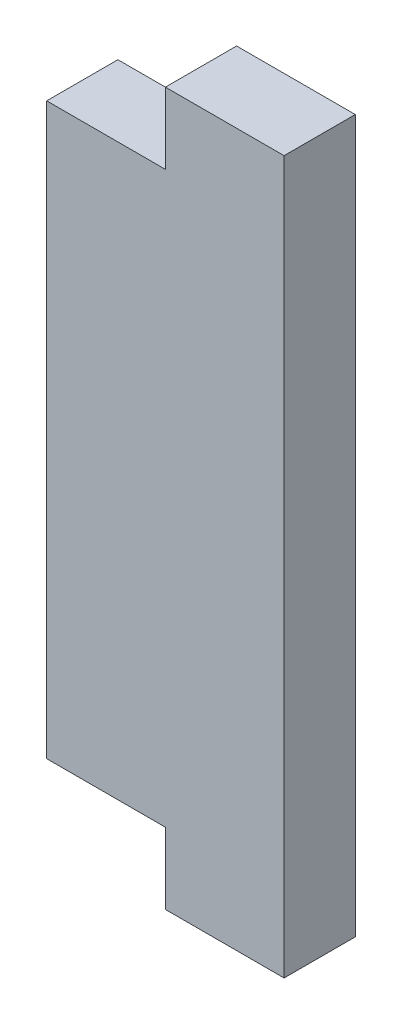
ISO-10303-21;
HEADER;
FILE_DESCRIPTION(('STEP AP214'),'2;1');
FILE_NAME('part.step','',(''),(''),'','','');
FILE_SCHEMA(('AUTOMOTIVE_DESIGN { 1 0 10303 214 1 1 1 1 }'));
ENDSEC;
DATA;
#1=APPLICATION_CONTEXT('core data for automotive mechanical design processes');
#2=APPLICATION_PROTOCOL_DEFINITION('international standard','automotive_design',2000,#1);
#3=PRODUCT_CONTEXT('',#1,'mechanical');
#4=PRODUCT('Part','Part','',(#3));
#5=PRODUCT_RELATED_PRODUCT_CATEGORY('part','',(#4));
#6=PRODUCT_DEFINITION_FORMATION('','',#4);
#7=PRODUCT_DEFINITION_CONTEXT('part definition',#1,'design');
#8=PRODUCT_DEFINITION('design','',#6,#7);
#9=PRODUCT_DEFINITION_SHAPE('','',#8);
#10=(LENGTH_UNIT() NAMED_UNIT(*) SI_UNIT(.MILLI.,.METRE.));
#11=(NAMED_UNIT(*) PLANE_ANGLE_UNIT() SI_UNIT($,.RADIAN.));
#12=(NAMED_UNIT(*) SI_UNIT($,.STERADIAN.) SOLID_ANGLE_UNIT());
#13=UNCERTAINTY_MEASURE_WITH_UNIT(LENGTH_MEASURE(1.E-05),#10,'distance_accuracy_value','');
#14=(GEOMETRIC_REPRESENTATION_CONTEXT(3) GLOBAL_UNCERTAINTY_ASSIGNED_CONTEXT((#13)) GLOBAL_UNIT_ASSIGNED_CONTEXT((#10,
#11,#12)) REPRESENTATION_CONTEXT('',''));
#15=CARTESIAN_POINT('',(0.,0.,0.));
#16=DIRECTION('',(0.,0.,1.));
#17=DIRECTION('',(1.,0.,0.));
#18=AXIS2_PLACEMENT_3D('',#15,#16,#17);
#19=CARTESIAN_POINT('',(0.,59.9999999999999,6.));
#20=DIRECTION('',(-1.,0.,0.));
#21=DIRECTION('',(0.,-1.,0.));
#22=AXIS2_PLACEMENT_3D('',#19,#20,#21);
#23=PLANE('',#22);
#24=DIRECTION('',(0.,1.,0.));
#25=VECTOR('',#24,1.);
#26=CARTESIAN_POINT('',(0.,59.9999999999999,0.));
#27=LINE('',#26,#25);
#28=CARTESIAN_POINT('',(0.,0.,0.));
#29=VERTEX_POINT('',#28);
#30=CARTESIAN_POINT('',(0.,59.9999999999999,0.));
#31=VERTEX_POINT('',#30);
#32=EDGE_CURVE('E129',#29,#31,#27,.T.);
#33=ORIENTED_EDGE('',*,*,#32,.T.);
#34=DIRECTION('',(0.,0.,-1.));
#35=VECTOR('',#34,1.);
#36=CARTESIAN_POINT('',(0.,59.9999999999999,6.));
#37=LINE('',#36,#35);
#38=CARTESIAN_POINT('',(0.,59.9999999999999,6.));
#39=VERTEX_POINT('',#38);
#40=EDGE_CURVE('E11',#39,#31,#37,.T.);
#41=ORIENTED_EDGE('',*,*,#40,.F.);
#42=DIRECTION('',(0.,1.,0.));
#43=VECTOR('',#42,1.);
#44=CARTESIAN_POINT('',(0.,59.9999999999999,6.));
#45=LINE('',#44,#43);
#46=CARTESIAN_POINT('',(0.,0.,6.));
#47=VERTEX_POINT('',#46);
#48=EDGE_CURVE('E143',#47,#39,#45,.T.);
#49=ORIENTED_EDGE('',*,*,#48,.F.);
#50=DIRECTION('',(0.,0.,-1.));
#51=VECTOR('',#50,1.);
#52=CARTESIAN_POINT('',(0.,0.,6.));
#53=LINE('',#52,#51);
#54=EDGE_CURVE('E125',#47,#29,#53,.T.);
#55=ORIENTED_EDGE('',*,*,#54,.T.);
#56=EDGE_LOOP('',(#33,#41,#49,#55));
#57=FACE_BOUND('',#56,.T.);
#58=ADVANCED_FACE('F33',(#57),#23,.F.);
#59=CARTESIAN_POINT('',(-9.99999999999986,59.9999999999999,6.));
#60=DIRECTION('',(0.,-1.,0.));
#61=DIRECTION('',(0.,0.,-1.));
#62=AXIS2_PLACEMENT_3D('',#59,#60,#61);
#63=PLANE('',#62);
#64=DIRECTION('',(-1.,0.,0.));
#65=VECTOR('',#64,1.);
#66=CARTESIAN_POINT('',(-9.99999999999986,59.9999999999999,0.));
#67=LINE('',#66,#65);
#68=CARTESIAN_POINT('',(-9.99999999999986,59.9999999999999,0.));
#69=VERTEX_POINT('',#68);
#70=EDGE_CURVE('E132',#31,#69,#67,.T.);
#71=ORIENTED_EDGE('',*,*,#70,.T.);
#72=DIRECTION('',(0.,0.,-1.));
#73=VECTOR('',#72,1.);
#74=CARTESIAN_POINT('',(-9.99999999999986,59.9999999999999,6.));
#75=LINE('',#74,#73);
#76=CARTESIAN_POINT('',(-9.99999999999986,59.9999999999999,6.));
#77=VERTEX_POINT('',#76);
#78=EDGE_CURVE('E41',#77,#69,#75,.T.);
#79=ORIENTED_EDGE('',*,*,#78,.F.);
#80=DIRECTION('',(-1.,0.,0.));
#81=VECTOR('',#80,1.);
#82=CARTESIAN_POINT('',(-9.99999999999986,59.9999999999999,6.));
#83=LINE('',#82,#81);
#84=EDGE_CURVE('E92',#39,#77,#83,.T.);
#85=ORIENTED_EDGE('',*,*,#84,.F.);
#86=ORIENTED_EDGE('',*,*,#40,.T.);
#87=EDGE_LOOP('',(#71,#79,#85,#86));
#88=FACE_BOUND('',#87,.T.);
#89=ADVANCED_FACE('F178',(#88),#63,.F.);
#90=CARTESIAN_POINT('',(-9.99999999999986,59.9999999999999,6.));
#91=DIRECTION('',(1.,0.,0.));
#92=DIRECTION('',(0.,0.,-1.));
#93=AXIS2_PLACEMENT_3D('',#90,#91,#92);
#94=PLANE('',#93);
#95=DIRECTION('',(0.,-1.,0.));
#96=VECTOR('',#95,1.);
#97=CARTESIAN_POINT('',(-9.99999999999986,59.9999999999999,0.));
#98=LINE('',#97,#96);
#99=CARTESIAN_POINT('',(-9.99999999999986,53.9999999999998,0.));
#100=VERTEX_POINT('',#99);
#101=EDGE_CURVE('E134',#69,#100,#98,.T.);
#102=ORIENTED_EDGE('',*,*,#101,.T.);
#103=DIRECTION('',(0.,0.,-1.));
#104=VECTOR('',#103,1.);
#105=CARTESIAN_POINT('',(-9.99999999999986,53.9999999999998,6.));
#106=LINE('',#105,#104);
#107=CARTESIAN_POINT('',(-9.99999999999986,53.9999999999998,6.));
#108=VERTEX_POINT('',#107);
#109=EDGE_CURVE('E150',#108,#100,#106,.T.);
#110=ORIENTED_EDGE('',*,*,#109,.F.);
#111=DIRECTION('',(0.,-1.,0.));
#112=VECTOR('',#111,1.);
#113=CARTESIAN_POINT('',(-9.99999999999986,59.9999999999999,6.));
#114=LINE('',#113,#112);
#115=EDGE_CURVE('E158',#77,#108,#114,.T.);
#116=ORIENTED_EDGE('',*,*,#115,.F.);
#117=ORIENTED_EDGE('',*,*,#78,.T.);
#118=EDGE_LOOP('',(#102,#110,#116,#117));
#119=FACE_BOUND('',#118,.T.);
#120=ADVANCED_FACE('F156',(#119),#94,.F.);
#121=CARTESIAN_POINT('',(-19.9999999999999,53.9999999999998,6.));
#122=DIRECTION('',(0.,-1.,0.));
#123=DIRECTION('',(0.,0.,-1.));
#124=AXIS2_PLACEMENT_3D('',#121,#122,#123);
#125=PLANE('',#124);
#126=DIRECTION('',(-1.,0.,0.));
#127=VECTOR('',#126,1.);
#128=CARTESIAN_POINT('',(-19.9999999999999,53.9999999999998,0.));
#129=LINE('',#128,#127);
#130=CARTESIAN_POINT('',(-19.9999999999999,53.9999999999998,0.));
#131=VERTEX_POINT('',#130);
#132=EDGE_CURVE('E136',#100,#131,#129,.T.);
#133=ORIENTED_EDGE('',*,*,#132,.T.);
#134=DIRECTION('',(0.,0.,-1.));
#135=VECTOR('',#134,1.);
#136=CARTESIAN_POINT('',(-19.9999999999999,53.9999999999998,6.));
#137=LINE('',#136,#135);
#138=CARTESIAN_POINT('',(-19.9999999999999,53.9999999999998,6.));
#139=VERTEX_POINT('',#138);
#140=EDGE_CURVE('E147',#139,#131,#137,.T.);
#141=ORIENTED_EDGE('',*,*,#140,.F.);
#142=DIRECTION('',(-1.,0.,0.));
#143=VECTOR('',#142,1.);
#144=CARTESIAN_POINT('',(-19.9999999999999,53.9999999999998,6.));
#145=LINE('',#144,#143);
#146=EDGE_CURVE('E170',#108,#139,#145,.T.);
#147=ORIENTED_EDGE('',*,*,#146,.F.);
#148=ORIENTED_EDGE('',*,*,#109,.T.);
#149=EDGE_LOOP('',(#133,#141,#147,#148));
#150=FACE_BOUND('',#149,.T.);
#151=ADVANCED_FACE('F166',(#150),#125,.F.);
#152=CARTESIAN_POINT('',(-19.9999999999999,53.9999999999998,6.));
#153=DIRECTION('',(1.,0.,0.));
#154=DIRECTION('',(0.,1.,0.));
#155=AXIS2_PLACEMENT_3D('',#152,#153,#154);
#156=PLANE('',#155);
#157=DIRECTION('',(0.,-1.,0.));
#158=VECTOR('',#157,1.);
#159=CARTESIAN_POINT('',(-19.9999999999999,53.9999999999998,0.));
#160=LINE('',#159,#158);
#161=CARTESIAN_POINT('',(-19.9999999999999,6.,0.));
#162=VERTEX_POINT('',#161);
#163=EDGE_CURVE('E138',#131,#162,#160,.T.);
#164=ORIENTED_EDGE('',*,*,#163,.T.);
#165=DIRECTION('',(0.,0.,-1.));
#166=VECTOR('',#165,1.);
#167=CARTESIAN_POINT('',(-19.9999999999999,6.,6.));
#168=LINE('',#167,#166);
#169=CARTESIAN_POINT('',(-19.9999999999999,6.,6.));
#170=VERTEX_POINT('',#169);
#171=EDGE_CURVE('E120',#170,#162,#168,.T.);
#172=ORIENTED_EDGE('',*,*,#171,.F.);
#173=DIRECTION('',(0.,-1.,0.));
#174=VECTOR('',#173,1.);
#175=CARTESIAN_POINT('',(-19.9999999999999,53.9999999999998,6.));
#176=LINE('',#175,#174);
#177=EDGE_CURVE('E111',#139,#170,#176,.T.);
#178=ORIENTED_EDGE('',*,*,#177,.F.);
#179=ORIENTED_EDGE('',*,*,#140,.T.);
#180=EDGE_LOOP('',(#164,#172,#178,#179));
#181=FACE_BOUND('',#180,.T.);
#182=ADVANCED_FACE('F169',(#181),#156,.F.);
#183=CARTESIAN_POINT('',(-19.9999999999999,6.,6.));
#184=DIRECTION('',(0.,1.,0.));
#185=DIRECTION('',(0.,0.,1.));
#186=AXIS2_PLACEMENT_3D('',#183,#184,#185);
#187=PLANE('',#186);
#188=DIRECTION('',(1.,0.,0.));
#189=VECTOR('',#188,1.);
#190=CARTESIAN_POINT('',(-19.9999999999999,6.,0.));
#191=LINE('',#190,#189);
#192=CARTESIAN_POINT('',(-9.99999999999993,6.,0.));
#193=VERTEX_POINT('',#192);
#194=EDGE_CURVE('E119',#162,#193,#191,.T.);
#195=ORIENTED_EDGE('',*,*,#194,.T.);
#196=DIRECTION('',(0.,0.,-1.));
#197=VECTOR('',#196,1.);
#198=CARTESIAN_POINT('',(-9.99999999999993,6.,6.));
#199=LINE('',#198,#197);
#200=CARTESIAN_POINT('',(-9.99999999999993,6.,6.));
#201=VERTEX_POINT('',#200);
#202=EDGE_CURVE('E116',#201,#193,#199,.T.);
#203=ORIENTED_EDGE('',*,*,#202,.F.);
#204=DIRECTION('',(1.,0.,0.));
#205=VECTOR('',#204,1.);
#206=CARTESIAN_POINT('',(-19.9999999999999,6.,6.));
#207=LINE('',#206,#205);
#208=EDGE_CURVE('E105',#170,#201,#207,.T.);
#209=ORIENTED_EDGE('',*,*,#208,.F.);
#210=ORIENTED_EDGE('',*,*,#171,.T.);
#211=EDGE_LOOP('',(#195,#203,#209,#210));
#212=FACE_BOUND('',#211,.T.);
#213=ADVANCED_FACE('F117',(#212),#187,.F.);
#214=CARTESIAN_POINT('',(-9.99999999999993,0.,6.));
#215=DIRECTION('',(1.,0.,0.));
#216=DIRECTION('',(0.,0.,-1.));
#217=AXIS2_PLACEMENT_3D('',#214,#215,#216);
#218=PLANE('',#217);
#219=DIRECTION('',(0.,-1.,0.));
#220=VECTOR('',#219,1.);
#221=CARTESIAN_POINT('',(-9.99999999999993,0.,0.));
#222=LINE('',#221,#220);
#223=CARTESIAN_POINT('',(-9.99999999999993,0.,0.));
#224=VERTEX_POINT('',#223);
#225=EDGE_CURVE('E78',#193,#224,#222,.T.);
#226=ORIENTED_EDGE('',*,*,#225,.T.);
#227=DIRECTION('',(0.,0.,-1.));
#228=VECTOR('',#227,1.);
#229=CARTESIAN_POINT('',(-9.99999999999993,0.,6.));
#230=LINE('',#229,#228);
#231=CARTESIAN_POINT('',(-9.99999999999993,0.,6.));
#232=VERTEX_POINT('',#231);
#233=EDGE_CURVE('E121',#232,#224,#230,.T.);
#234=ORIENTED_EDGE('',*,*,#233,.F.);
#235=DIRECTION('',(0.,-1.,0.));
#236=VECTOR('',#235,1.);
#237=CARTESIAN_POINT('',(-9.99999999999993,0.,6.));
#238=LINE('',#237,#236);
#239=EDGE_CURVE('E109',#201,#232,#238,.T.);
#240=ORIENTED_EDGE('',*,*,#239,.F.);
#241=ORIENTED_EDGE('',*,*,#202,.T.);
#242=EDGE_LOOP('',(#226,#234,#240,#241));
#243=FACE_BOUND('',#242,.T.);
#244=ADVANCED_FACE('F123',(#243),#218,.F.);
#245=CARTESIAN_POINT('',(-9.99999999999993,0.,6.));
#246=DIRECTION('',(0.,1.,0.));
#247=DIRECTION('',(0.,0.,1.));
#248=AXIS2_PLACEMENT_3D('',#245,#246,#247);
#249=PLANE('',#248);
#250=DIRECTION('',(1.,0.,0.));
#251=VECTOR('',#250,1.);
#252=CARTESIAN_POINT('',(-9.99999999999993,0.,0.));
#253=LINE('',#252,#251);
#254=EDGE_CURVE('E84',#224,#29,#253,.T.);
#255=ORIENTED_EDGE('',*,*,#254,.T.);
#256=ORIENTED_EDGE('',*,*,#54,.F.);
#257=DIRECTION('',(1.,0.,0.));
#258=VECTOR('',#257,1.);
#259=CARTESIAN_POINT('',(-9.99999999999993,0.,6.));
#260=LINE('',#259,#258);
#261=EDGE_CURVE('E49',#232,#47,#260,.T.);
#262=ORIENTED_EDGE('',*,*,#261,.F.);
#263=ORIENTED_EDGE('',*,*,#233,.T.);
#264=EDGE_LOOP('',(#255,#256,#262,#263));
#265=FACE_BOUND('',#264,.T.);
#266=ADVANCED_FACE('F194',(#265),#249,.F.);
#267=CARTESIAN_POINT('',(0.,0.,6.));
#268=DIRECTION('',(0.,0.,1.));
#269=DIRECTION('',(1.,0.,0.));
#270=AXIS2_PLACEMENT_3D('',#267,#268,#269);
#271=PLANE('',#270);
#272=ORIENTED_EDGE('',*,*,#48,.T.);
#273=ORIENTED_EDGE('',*,*,#84,.T.);
#274=ORIENTED_EDGE('',*,*,#115,.T.);
#275=ORIENTED_EDGE('',*,*,#146,.T.);
#276=ORIENTED_EDGE('',*,*,#177,.T.);
#277=ORIENTED_EDGE('',*,*,#208,.T.);
#278=ORIENTED_EDGE('',*,*,#239,.T.);
#279=ORIENTED_EDGE('',*,*,#261,.T.);
#280=EDGE_LOOP('',(#272,#273,#274,#275,#276,#277,#278,#279));
#281=FACE_BOUND('',#280,.T.);
#282=ADVANCED_FACE('F107',(#281),#271,.T.);
#283=CARTESIAN_POINT('',(0.,0.,0.));
#284=DIRECTION('',(0.,0.,1.));
#285=DIRECTION('',(1.,0.,0.));
#286=AXIS2_PLACEMENT_3D('',#283,#284,#285);
#287=PLANE('',#286);
#288=ORIENTED_EDGE('',*,*,#32,.F.);
#289=ORIENTED_EDGE('',*,*,#254,.F.);
#290=ORIENTED_EDGE('',*,*,#225,.F.);
#291=ORIENTED_EDGE('',*,*,#194,.F.);
#292=ORIENTED_EDGE('',*,*,#163,.F.);
#293=ORIENTED_EDGE('',*,*,#132,.F.);
#294=ORIENTED_EDGE('',*,*,#101,.F.);
#295=ORIENTED_EDGE('',*,*,#70,.F.);
#296=EDGE_LOOP('',(#288,#289,#290,#291,#292,#293,#294,#295));
#297=FACE_BOUND('',#296,.T.);
#298=ADVANCED_FACE('F162',(#297),#287,.F.);
#299=CLOSED_SHELL('',(#58,#89,#120,#151,#182,#213,#244,#266,#282,#298));
#300=MANIFOLD_SOLID_BREP('B2',#299);
#301=ADVANCED_BREP_SHAPE_REPRESENTATION('',(#18,#300),#14);
#302=SHAPE_DEFINITION_REPRESENTATION(#9,#301);
ENDSEC;
END-ISO-10303-21;
